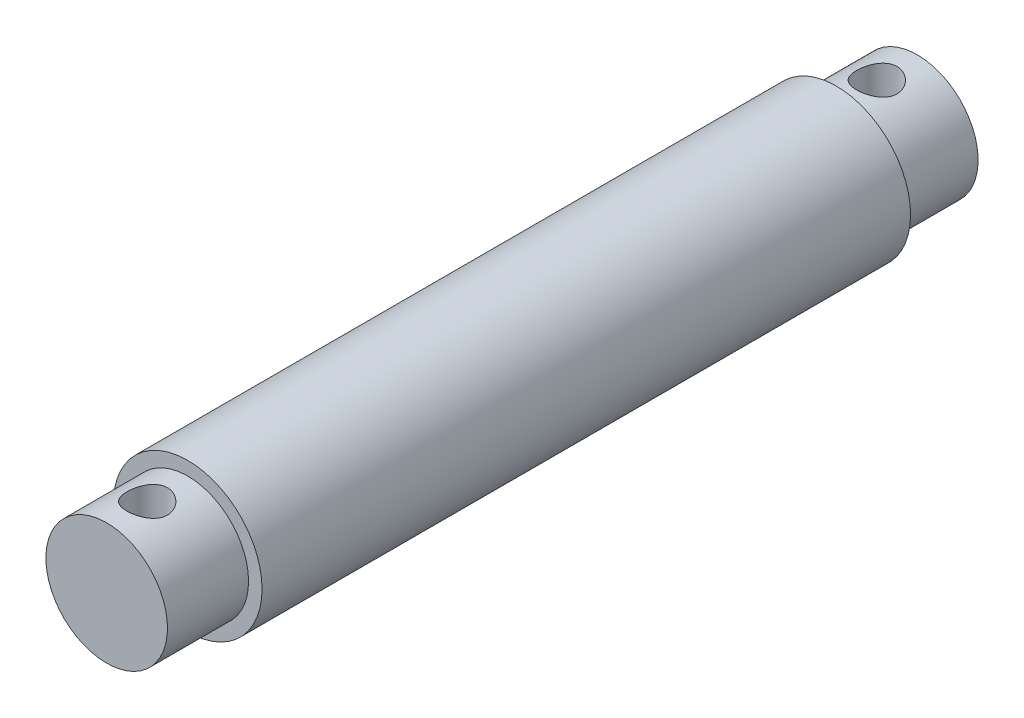
ISO-10303-21;
HEADER;
FILE_DESCRIPTION(('STEP AP214'),'2;1');
FILE_NAME('part.step','',(''),(''),'','','');
FILE_SCHEMA(('AUTOMOTIVE_DESIGN { 1 0 10303 214 1 1 1 1 }'));
ENDSEC;
DATA;
#1=APPLICATION_CONTEXT('core data for automotive mechanical design processes');
#2=APPLICATION_PROTOCOL_DEFINITION('international standard','automotive_design',2000,#1);
#3=PRODUCT_CONTEXT('',#1,'mechanical');
#4=PRODUCT('Part','Part','',(#3));
#5=PRODUCT_RELATED_PRODUCT_CATEGORY('part','',(#4));
#6=PRODUCT_DEFINITION_FORMATION('','',#4);
#7=PRODUCT_DEFINITION_CONTEXT('part definition',#1,'design');
#8=PRODUCT_DEFINITION('design','',#6,#7);
#9=PRODUCT_DEFINITION_SHAPE('','',#8);
#10=(LENGTH_UNIT() NAMED_UNIT(*) SI_UNIT(.MILLI.,.METRE.));
#11=(NAMED_UNIT(*) PLANE_ANGLE_UNIT() SI_UNIT($,.RADIAN.));
#12=(NAMED_UNIT(*) SI_UNIT($,.STERADIAN.) SOLID_ANGLE_UNIT());
#13=UNCERTAINTY_MEASURE_WITH_UNIT(LENGTH_MEASURE(1.E-05),#10,'distance_accuracy_value','');
#14=(GEOMETRIC_REPRESENTATION_CONTEXT(3) GLOBAL_UNCERTAINTY_ASSIGNED_CONTEXT((#13)) GLOBAL_UNIT_ASSIGNED_CONTEXT((#10,
#11,#12)) REPRESENTATION_CONTEXT('',''));
#15=CARTESIAN_POINT('',(0.,0.,0.));
#16=DIRECTION('',(0.,0.,1.));
#17=DIRECTION('',(1.,0.,0.));
#18=AXIS2_PLACEMENT_3D('',#15,#16,#17);
#19=CARTESIAN_POINT('',(0.,0.,48.));
#20=DIRECTION('',(0.,0.,-1.));
#21=DIRECTION('',(-1.,0.,0.));
#22=AXIS2_PLACEMENT_3D('',#19,#20,#21);
#23=CYLINDRICAL_SURFACE('',#22,5.5);
#24=CARTESIAN_POINT('',(0.,0.,48.));
#25=DIRECTION('',(0.,0.,1.));
#26=DIRECTION('',(1.,0.,0.));
#27=AXIS2_PLACEMENT_3D('',#24,#25,#26);
#28=CIRCLE('',#27,5.5);
#29=CARTESIAN_POINT('',(5.5,0.,48.));
#30=VERTEX_POINT('',#29);
#31=EDGE_CURVE('E62',#30,#30,#28,.T.);
#32=ORIENTED_EDGE('',*,*,#31,.F.);
#33=EDGE_LOOP('',(#32));
#34=FACE_BOUND('',#33,.T.);
#35=CARTESIAN_POINT('',(0.,0.,0.));
#36=DIRECTION('',(0.,0.,1.));
#37=DIRECTION('',(1.,0.,0.));
#38=AXIS2_PLACEMENT_3D('',#35,#36,#37);
#39=CIRCLE('',#38,5.5);
#40=CARTESIAN_POINT('',(5.5,0.,0.));
#41=VERTEX_POINT('',#40);
#42=EDGE_CURVE('E70',#41,#41,#39,.T.);
#43=ORIENTED_EDGE('',*,*,#42,.T.);
#44=EDGE_LOOP('',(#43));
#45=FACE_BOUND('',#44,.T.);
#46=ADVANCED_FACE('F43',(#34,#45),#23,.T.);
#47=CARTESIAN_POINT('',(0.,0.,48.));
#48=DIRECTION('',(0.,0.,1.));
#49=DIRECTION('',(1.,0.,0.));
#50=AXIS2_PLACEMENT_3D('',#47,#48,#49);
#51=PLANE('',#50);
#52=CARTESIAN_POINT('',(0.,0.,48.));
#53=DIRECTION('',(0.,0.,1.));
#54=DIRECTION('',(1.,0.,0.));
#55=AXIS2_PLACEMENT_3D('',#52,#53,#54);
#56=CIRCLE('',#55,4.5);
#57=CARTESIAN_POINT('',(4.5,0.,48.));
#58=VERTEX_POINT('',#57);
#59=EDGE_CURVE('E56',#58,#58,#56,.T.);
#60=ORIENTED_EDGE('',*,*,#59,.F.);
#61=EDGE_LOOP('',(#60));
#62=FACE_BOUND('',#61,.T.);
#63=ORIENTED_EDGE('',*,*,#31,.T.);
#64=EDGE_LOOP('',(#63));
#65=FACE_BOUND('',#64,.T.);
#66=ADVANCED_FACE('F119',(#62,#65),#51,.T.);
#67=CARTESIAN_POINT('',(0.,0.,0.));
#68=DIRECTION('',(0.,0.,1.));
#69=DIRECTION('',(1.,0.,0.));
#70=AXIS2_PLACEMENT_3D('',#67,#68,#69);
#71=PLANE('',#70);
#72=CARTESIAN_POINT('',(0.,0.,0.));
#73=DIRECTION('',(0.,0.,-1.));
#74=DIRECTION('',(-1.,0.,0.));
#75=AXIS2_PLACEMENT_3D('',#72,#73,#74);
#76=CIRCLE('',#75,4.5);
#77=CARTESIAN_POINT('',(-4.5,0.,0.));
#78=VERTEX_POINT('',#77);
#79=EDGE_CURVE('E10',#78,#78,#76,.T.);
#80=ORIENTED_EDGE('',*,*,#79,.F.);
#81=EDGE_LOOP('',(#80));
#82=FACE_BOUND('',#81,.T.);
#83=ORIENTED_EDGE('',*,*,#42,.F.);
#84=EDGE_LOOP('',(#83));
#85=FACE_BOUND('',#84,.T.);
#86=ADVANCED_FACE('F117',(#82,#85),#71,.F.);
#87=CARTESIAN_POINT('',(0.,0.,54.));
#88=DIRECTION('',(0.,0.,-1.));
#89=DIRECTION('',(-1.,0.,0.));
#90=AXIS2_PLACEMENT_3D('',#87,#88,#89);
#91=CYLINDRICAL_SURFACE('',#90,4.5);
#92=CARTESIAN_POINT('',(0.,-4.5,52.5));
#93=CARTESIAN_POINT('',(0.081845044330085,-4.50000022951416,52.5000003805975));
#94=CARTESIAN_POINT('',(0.163687791807825,-4.49774654261317,52.4932796008092));
#95=CARTESIAN_POINT('',(0.324962641309459,-4.48897815304921,52.4666563367742));
#96=CARTESIAN_POINT('',(0.404394492178227,-4.48246300803229,52.4467524840766));
#97=CARTESIAN_POINT('',(0.558499184252666,-4.46587961859664,52.3945211349239));
#98=CARTESIAN_POINT('',(0.633179738829053,-4.4558173159628,52.3622144063111));
#99=CARTESIAN_POINT('',(0.776062405207989,-4.43316668576013,52.2861882407425));
#100=CARTESIAN_POINT('',(0.844263235438061,-4.42057786001667,52.2424665524961));
#101=CARTESIAN_POINT('',(0.974612512533401,-4.39371141664507,52.1432612927119));
#102=CARTESIAN_POINT('',(1.03650555044747,-4.37939334695677,52.0874531486093));
#103=CARTESIAN_POINT('',(1.15024903905313,-4.35090472174682,51.9663492679402));
#104=CARTESIAN_POINT('',(1.20209727823419,-4.33673419935824,51.9010514476072));
#105=CARTESIAN_POINT('',(1.29573741334179,-4.30969998715911,51.7605223272053));
#106=CARTESIAN_POINT('',(1.33719728733155,-4.29688558913532,51.6850593904018));
#107=CARTESIAN_POINT('',(1.40672831081658,-4.27462958127902,51.5277358583122));
#108=CARTESIAN_POINT('',(1.43480354608015,-4.26518694241118,51.4458772242559));
#109=CARTESIAN_POINT('',(1.47581019226375,-4.25116954904066,51.2809901677549));
#110=CARTESIAN_POINT('',(1.48922017240765,-4.24644143654417,51.1980941872664));
#111=CARTESIAN_POINT('',(1.50201168500172,-4.24193484944261,51.0311043687662));
#112=CARTESIAN_POINT('',(1.50139755240708,-4.24215484534095,50.9470109089362));
#113=CARTESIAN_POINT('',(1.48652985555513,-4.2473852251227,50.784095054334));
#114=CARTESIAN_POINT('',(1.47290086975049,-4.25217623801299,50.7052073956215));
#115=CARTESIAN_POINT('',(1.43340924427412,-4.26564986586826,50.5509098705897));
#116=CARTESIAN_POINT('',(1.4075451398878,-4.27433294676161,50.4755004218474));
#117=CARTESIAN_POINT('',(1.34390858709031,-4.29476866696873,50.3288808756128));
#118=CARTESIAN_POINT('',(1.30595107306089,-4.30656848689676,50.2577579617957));
#119=CARTESIAN_POINT('',(1.21933365945471,-4.3318883786359,50.1226936375804));
#120=CARTESIAN_POINT('',(1.17067066854601,-4.34540894685695,50.0587543095999));
#121=CARTESIAN_POINT('',(1.06102399902336,-4.37350993751611,49.9363626027588));
#122=CARTESIAN_POINT('',(0.999529725114467,-4.38810884032264,49.8783709582364));
#123=CARTESIAN_POINT('',(0.867509354955095,-4.41610407580555,49.7734031000049));
#124=CARTESIAN_POINT('',(0.796982393491219,-4.42950029307101,49.7264279427532));
#125=CARTESIAN_POINT('',(0.6479214195694,-4.4537566190669,49.6444555496474));
#126=CARTESIAN_POINT('',(0.569314914624506,-4.46459025012059,49.6095817629889));
#127=CARTESIAN_POINT('',(0.406903625046763,-4.48230850716652,49.5536952390664));
#128=CARTESIAN_POINT('',(0.323100657232431,-4.48919450482319,49.5326776868648));
#129=CARTESIAN_POINT('',(0.156575744293956,-4.49801440607161,49.5059165009665));
#130=CARTESIAN_POINT('',(0.0739643997972691,-4.50015002750592,49.4995502862409));
#131=CARTESIAN_POINT('',(-0.0911626049403566,-4.49983354042241,49.5004990103977));
#132=CARTESIAN_POINT('',(-0.173678278979476,-4.49738220629043,49.5078116399698));
#133=CARTESIAN_POINT('',(-0.333779799456384,-4.48830037075656,49.5354178616039));
#134=CARTESIAN_POINT('',(-0.411439210252265,-4.48179298066788,49.5553293090742));
#135=CARTESIAN_POINT('',(-0.562283937869361,-4.46537770245105,49.6070901667001));
#136=CARTESIAN_POINT('',(-0.63546868276291,-4.45546938070013,49.6389410992017));
#137=CARTESIAN_POINT('',(-0.777432444589911,-4.43293396930935,49.7146056477612));
#138=CARTESIAN_POINT('',(-0.846044938825721,-4.42024222133679,49.7587118899248));
#139=CARTESIAN_POINT('',(-0.97509724520338,-4.39357880874394,49.8572912250202));
#140=CARTESIAN_POINT('',(-1.03553455169337,-4.37960675390741,49.9117674840476));
#141=CARTESIAN_POINT('',(-1.14937876170945,-4.35115271970667,50.0324681265099));
#142=CARTESIAN_POINT('',(-1.20234145386866,-4.33667641631142,50.0991138403903));
#143=CARTESIAN_POINT('',(-1.29638628348536,-4.30949959942063,50.2406573517163));
#144=CARTESIAN_POINT('',(-1.33746832189652,-4.29679910073003,50.3155552179511));
#145=CARTESIAN_POINT('',(-1.40639539562454,-4.27473587687075,50.4715095229348));
#146=CARTESIAN_POINT('',(-1.43426719824753,-4.26536641189468,50.5525531187531));
#147=CARTESIAN_POINT('',(-1.47584200013903,-4.25116248459674,50.7185679750662));
#148=CARTESIAN_POINT('',(-1.48955138243091,-4.24632597935459,50.8035374481065));
#149=CARTESIAN_POINT('',(-1.50191442371601,-4.24196788311266,50.9702956440614));
#150=CARTESIAN_POINT('',(-1.5013053859626,-4.24218600386123,51.0520235104302));
#151=CARTESIAN_POINT('',(-1.48686344017304,-4.24726904735801,51.2141476123831));
#152=CARTESIAN_POINT('',(-1.47303131918788,-4.25213369354042,51.2945439269326));
#153=CARTESIAN_POINT('',(-1.43305771969402,-4.26576786457337,51.4502034945037));
#154=CARTESIAN_POINT('',(-1.40715501902327,-4.27446147033716,51.5255352375067));
#155=CARTESIAN_POINT('',(-1.34396904863962,-4.29474598227703,51.6708411104074));
#156=CARTESIAN_POINT('',(-1.30668325283071,-4.30633753145089,51.740814046782));
#157=CARTESIAN_POINT('',(-1.21989103887515,-4.33174243839069,51.8767255048844));
#158=CARTESIAN_POINT('',(-1.16992236414688,-4.34563067463205,51.9423547528476));
#159=CARTESIAN_POINT('',(-1.05996432470348,-4.37375034424879,52.0645347200763));
#160=CARTESIAN_POINT('',(-0.999972126677225,-4.38798187368558,52.1210828635321));
#161=CARTESIAN_POINT('',(-0.868862335381033,-4.41585045788316,52.2257166184338));
#162=CARTESIAN_POINT('',(-0.797402270249594,-4.42944272701885,52.2733865216265));
#163=CARTESIAN_POINT('',(-0.647036036109938,-4.45388986758918,52.355985643276));
#164=CARTESIAN_POINT('',(-0.568131777198522,-4.46474543861895,52.3909181188831));
#165=CARTESIAN_POINT('',(-0.408740470801463,-4.48208272602813,52.445582448733));
#166=CARTESIAN_POINT('',(-0.328481636514612,-4.48873818633784,52.4659236993951));
#167=CARTESIAN_POINT('',(-0.16548062401537,-4.49769610596333,52.4931304210157));
#168=CARTESIAN_POINT('',(-0.0827391383531194,-4.49999976797857,52.4999996152448));
#169=CARTESIAN_POINT('',(0.,-4.5,52.5));
#170=B_SPLINE_CURVE_WITH_KNOTS('',3,(#92,#93,#94,#95,#96,#97,#98,#99,#100,#101,#102,#103,#104,
#105,#106,#107,#108,#109,#110,#111,#112,#113,#114,#115,#116,#117,#118,#119,#120,#121,#122,#123,
#124,#125,#126,#127,#128,#129,#130,#131,#132,#133,#134,#135,#136,#137,#138,#139,#140,#141,#142,
#143,#144,#145,#146,#147,#148,#149,#150,#151,#152,#153,#154,#155,#156,#157,#158,#159,#160,#161,
#162,#163,#164,#165,#166,#167,#168,#169),.UNSPECIFIED.,.T.,.F.,(4,2,2,2,2,2,2,2,2,2,2,2,2,2,2,2,
2,2,2,2,2,2,2,2,2,2,2,2,2,2,2,2,2,2,2,2,2,2,4),(0.,0.245230659039017,0.490486777901282,
0.735334009305415,0.980229566698654,1.23277026424134,1.48536649931296,1.74522577235206,
2.0050056703925,2.2560288861276,2.50697450981229,2.74645239826921,2.98595896283224,
3.22932256732697,3.47275653837311,3.72889958717051,3.98506718949928,4.24377608475536,
4.50239503315813,4.74980374762755,4.99717069746265,5.23737236967321,5.47760467926156,
5.72415599765606,5.97078271232837,6.22861534321128,6.48645012352495,6.74376020740157,
7.00095427058761,7.24493499096388,7.48890119027063,7.72823380620626,7.96761957263966,
8.21745100037707,8.46735316685669,8.72699491252651,8.98657021728685,9.23454837560721,
9.4824579905721),.UNSPECIFIED.);
#171=CARTESIAN_POINT('',(0.,-4.5,52.5));
#172=VERTEX_POINT('',#171);
#173=EDGE_CURVE('E46',#172,#172,#170,.T.);
#174=ORIENTED_EDGE('',*,*,#173,.T.);
#175=EDGE_LOOP('',(#174));
#176=FACE_BOUND('',#175,.T.);
#177=CARTESIAN_POINT('',(0.,4.5,52.5));
#178=CARTESIAN_POINT('',(-0.081845044330085,4.50000022951416,52.5000003805975));
#179=CARTESIAN_POINT('',(-0.163687791807825,4.49774654261317,52.4932796008092));
#180=CARTESIAN_POINT('',(-0.324962641309459,4.48897815304921,52.4666563367742));
#181=CARTESIAN_POINT('',(-0.404394492178227,4.48246300803229,52.4467524840766));
#182=CARTESIAN_POINT('',(-0.558499184252666,4.46587961859664,52.3945211349239));
#183=CARTESIAN_POINT('',(-0.633179738829053,4.4558173159628,52.3622144063111));
#184=CARTESIAN_POINT('',(-0.776062405207989,4.43316668576013,52.2861882407425));
#185=CARTESIAN_POINT('',(-0.844263235438061,4.42057786001667,52.2424665524961));
#186=CARTESIAN_POINT('',(-0.974612512533401,4.39371141664507,52.1432612927119));
#187=CARTESIAN_POINT('',(-1.03650555044747,4.37939334695677,52.0874531486093));
#188=CARTESIAN_POINT('',(-1.15024903905313,4.35090472174682,51.9663492679402));
#189=CARTESIAN_POINT('',(-1.20209727823419,4.33673419935824,51.9010514476072));
#190=CARTESIAN_POINT('',(-1.29573741334179,4.30969998715911,51.7605223272053));
#191=CARTESIAN_POINT('',(-1.33719728733155,4.29688558913532,51.6850593904018));
#192=CARTESIAN_POINT('',(-1.40672831081658,4.27462958127902,51.5277358583122));
#193=CARTESIAN_POINT('',(-1.43480354608015,4.26518694241118,51.4458772242559));
#194=CARTESIAN_POINT('',(-1.47581019226375,4.25116954904066,51.2809901677549));
#195=CARTESIAN_POINT('',(-1.48922017240765,4.24644143654417,51.1980941872664));
#196=CARTESIAN_POINT('',(-1.50201168500172,4.24193484944261,51.0311043687662));
#197=CARTESIAN_POINT('',(-1.50139755240708,4.24215484534095,50.9470109089362));
#198=CARTESIAN_POINT('',(-1.48652985555513,4.2473852251227,50.784095054334));
#199=CARTESIAN_POINT('',(-1.47290086975049,4.25217623801299,50.7052073956215));
#200=CARTESIAN_POINT('',(-1.43340924427412,4.26564986586826,50.5509098705897));
#201=CARTESIAN_POINT('',(-1.4075451398878,4.27433294676161,50.4755004218474));
#202=CARTESIAN_POINT('',(-1.34390858709031,4.29476866696873,50.3288808756128));
#203=CARTESIAN_POINT('',(-1.30595107306089,4.30656848689676,50.2577579617957));
#204=CARTESIAN_POINT('',(-1.21933365945471,4.3318883786359,50.1226936375804));
#205=CARTESIAN_POINT('',(-1.17067066854601,4.34540894685695,50.0587543095999));
#206=CARTESIAN_POINT('',(-1.06102399902336,4.37350993751611,49.9363626027588));
#207=CARTESIAN_POINT('',(-0.999529725114467,4.38810884032264,49.8783709582364));
#208=CARTESIAN_POINT('',(-0.867509354955095,4.41610407580555,49.7734031000049));
#209=CARTESIAN_POINT('',(-0.796982393491219,4.42950029307101,49.7264279427532));
#210=CARTESIAN_POINT('',(-0.6479214195694,4.4537566190669,49.6444555496474));
#211=CARTESIAN_POINT('',(-0.569314914624506,4.46459025012059,49.6095817629889));
#212=CARTESIAN_POINT('',(-0.406903625046763,4.48230850716652,49.5536952390664));
#213=CARTESIAN_POINT('',(-0.323100657232431,4.48919450482319,49.5326776868648));
#214=CARTESIAN_POINT('',(-0.156575744293956,4.49801440607161,49.5059165009665));
#215=CARTESIAN_POINT('',(-0.0739643997972691,4.50015002750592,49.4995502862409));
#216=CARTESIAN_POINT('',(0.0911626049403566,4.49983354042241,49.5004990103977));
#217=CARTESIAN_POINT('',(0.173678278979476,4.49738220629043,49.5078116399698));
#218=CARTESIAN_POINT('',(0.333779799456384,4.48830037075656,49.5354178616039));
#219=CARTESIAN_POINT('',(0.411439210252265,4.48179298066788,49.5553293090742));
#220=CARTESIAN_POINT('',(0.562283937869361,4.46537770245105,49.6070901667001));
#221=CARTESIAN_POINT('',(0.63546868276291,4.45546938070013,49.6389410992017));
#222=CARTESIAN_POINT('',(0.777432444589911,4.43293396930935,49.7146056477612));
#223=CARTESIAN_POINT('',(0.846044938825721,4.42024222133679,49.7587118899248));
#224=CARTESIAN_POINT('',(0.97509724520338,4.39357880874394,49.8572912250202));
#225=CARTESIAN_POINT('',(1.03553455169337,4.37960675390741,49.9117674840476));
#226=CARTESIAN_POINT('',(1.14937876170945,4.35115271970667,50.0324681265099));
#227=CARTESIAN_POINT('',(1.20234145386866,4.33667641631142,50.0991138403903));
#228=CARTESIAN_POINT('',(1.29638628348536,4.30949959942063,50.2406573517163));
#229=CARTESIAN_POINT('',(1.33746832189652,4.29679910073003,50.3155552179511));
#230=CARTESIAN_POINT('',(1.40639539562454,4.27473587687075,50.4715095229348));
#231=CARTESIAN_POINT('',(1.43426719824753,4.26536641189468,50.5525531187531));
#232=CARTESIAN_POINT('',(1.47584200013903,4.25116248459674,50.7185679750662));
#233=CARTESIAN_POINT('',(1.48955138243091,4.24632597935459,50.8035374481065));
#234=CARTESIAN_POINT('',(1.50191442371601,4.24196788311266,50.9702956440614));
#235=CARTESIAN_POINT('',(1.5013053859626,4.24218600386123,51.0520235104302));
#236=CARTESIAN_POINT('',(1.48686344017304,4.24726904735801,51.2141476123831));
#237=CARTESIAN_POINT('',(1.47303131918788,4.25213369354042,51.2945439269326));
#238=CARTESIAN_POINT('',(1.43305771969402,4.26576786457337,51.4502034945037));
#239=CARTESIAN_POINT('',(1.40715501902327,4.27446147033716,51.5255352375067));
#240=CARTESIAN_POINT('',(1.34396904863962,4.29474598227703,51.6708411104074));
#241=CARTESIAN_POINT('',(1.30668325283071,4.30633753145089,51.740814046782));
#242=CARTESIAN_POINT('',(1.21989103887515,4.33174243839069,51.8767255048844));
#243=CARTESIAN_POINT('',(1.16992236414688,4.34563067463205,51.9423547528476));
#244=CARTESIAN_POINT('',(1.05996432470348,4.37375034424879,52.0645347200763));
#245=CARTESIAN_POINT('',(0.999972126677225,4.38798187368558,52.1210828635321));
#246=CARTESIAN_POINT('',(0.868862335381033,4.41585045788316,52.2257166184338));
#247=CARTESIAN_POINT('',(0.797402270249594,4.42944272701885,52.2733865216265));
#248=CARTESIAN_POINT('',(0.647036036109938,4.45388986758918,52.355985643276));
#249=CARTESIAN_POINT('',(0.568131777198522,4.46474543861895,52.3909181188831));
#250=CARTESIAN_POINT('',(0.408740470801463,4.48208272602813,52.445582448733));
#251=CARTESIAN_POINT('',(0.328481636514612,4.48873818633784,52.4659236993951));
#252=CARTESIAN_POINT('',(0.16548062401537,4.49769610596333,52.4931304210157));
#253=CARTESIAN_POINT('',(0.0827391383531194,4.49999976797857,52.4999996152448));
#254=CARTESIAN_POINT('',(0.,4.5,52.5));
#255=B_SPLINE_CURVE_WITH_KNOTS('',3,(#177,#178,#179,#180,#181,#182,#183,#184,#185,#186,#187,
#188,#189,#190,#191,#192,#193,#194,#195,#196,#197,#198,#199,#200,#201,#202,#203,#204,#205,#206,
#207,#208,#209,#210,#211,#212,#213,#214,#215,#216,#217,#218,#219,#220,#221,#222,#223,#224,#225,
#226,#227,#228,#229,#230,#231,#232,#233,#234,#235,#236,#237,#238,#239,#240,#241,#242,#243,#244,
#245,#246,#247,#248,#249,#250,#251,#252,#253,#254),.UNSPECIFIED.,.T.,.F.,(4,2,2,2,2,2,2,2,2,2,2,
2,2,2,2,2,2,2,2,2,2,2,2,2,2,2,2,2,2,2,2,2,2,2,2,2,2,2,4),(0.,0.245230659039017,
0.490486777901282,0.735334009305415,0.980229566698654,1.23277026424134,1.48536649931296,
1.74522577235206,2.0050056703925,2.2560288861276,2.50697450981229,2.74645239826921,
2.98595896283224,3.22932256732697,3.47275653837311,3.72889958717051,3.98506718949928,
4.24377608475536,4.50239503315813,4.74980374762755,4.99717069746265,5.23737236967321,
5.47760467926156,5.72415599765606,5.97078271232837,6.22861534321128,6.48645012352495,
6.74376020740157,7.00095427058761,7.24493499096388,7.48890119027063,7.72823380620626,
7.96761957263966,8.21745100037707,8.46735316685669,8.72699491252651,8.98657021728685,
9.23454837560721,9.4824579905721),.UNSPECIFIED.);
#256=CARTESIAN_POINT('',(0.,4.5,52.5));
#257=VERTEX_POINT('',#256);
#258=EDGE_CURVE('E106',#257,#257,#255,.T.);
#259=ORIENTED_EDGE('',*,*,#258,.T.);
#260=EDGE_LOOP('',(#259));
#261=FACE_BOUND('',#260,.T.);
#262=CARTESIAN_POINT('',(0.,0.,54.));
#263=DIRECTION('',(0.,0.,1.));
#264=DIRECTION('',(1.,0.,0.));
#265=AXIS2_PLACEMENT_3D('',#262,#263,#264);
#266=CIRCLE('',#265,4.5);
#267=CARTESIAN_POINT('',(4.5,0.,54.));
#268=VERTEX_POINT('',#267);
#269=EDGE_CURVE('E67',#268,#268,#266,.T.);
#270=ORIENTED_EDGE('',*,*,#269,.F.);
#271=EDGE_LOOP('',(#270));
#272=FACE_BOUND('',#271,.T.);
#273=ORIENTED_EDGE('',*,*,#59,.T.);
#274=EDGE_LOOP('',(#273));
#275=FACE_BOUND('',#274,.T.);
#276=ADVANCED_FACE('F112',(#176,#261,#272,#275),#91,.T.);
#277=CARTESIAN_POINT('',(0.,0.,54.));
#278=DIRECTION('',(0.,0.,1.));
#279=DIRECTION('',(1.,0.,0.));
#280=AXIS2_PLACEMENT_3D('',#277,#278,#279);
#281=PLANE('',#280);
#282=ORIENTED_EDGE('',*,*,#269,.T.);
#283=EDGE_LOOP('',(#282));
#284=FACE_BOUND('',#283,.T.);
#285=ADVANCED_FACE('F116',(#284),#281,.T.);
#286=CARTESIAN_POINT('',(0.,0.,-6.));
#287=DIRECTION('',(0.,0.,1.));
#288=DIRECTION('',(1.,0.,0.));
#289=AXIS2_PLACEMENT_3D('',#286,#287,#288);
#290=CYLINDRICAL_SURFACE('',#289,4.5);
#291=CARTESIAN_POINT('',(0.,-4.5,-1.5));
#292=CARTESIAN_POINT('',(0.0818450443300848,-4.50000022951416,-1.49999961940254));
#293=CARTESIAN_POINT('',(0.163687791807825,-4.49774654261317,-1.50672039919083));
#294=CARTESIAN_POINT('',(0.324962641309458,-4.48897815304921,-1.53334366322583));
#295=CARTESIAN_POINT('',(0.404394492178227,-4.48246300803229,-1.55324751592338));
#296=CARTESIAN_POINT('',(0.558499184252664,-4.46587961859664,-1.60547886507607));
#297=CARTESIAN_POINT('',(0.633179738829051,-4.4558173159628,-1.63778559368891));
#298=CARTESIAN_POINT('',(0.776062405207987,-4.43316668576013,-1.71381175925752));
#299=CARTESIAN_POINT('',(0.844263235438059,-4.42057786001667,-1.7575334475039));
#300=CARTESIAN_POINT('',(0.9746125125334,-4.39371141664507,-1.85673870728813));
#301=CARTESIAN_POINT('',(1.03650555044746,-4.37939334695677,-1.91254685139074));
#302=CARTESIAN_POINT('',(1.15024903905313,-4.35090472174682,-2.03365073205985));
#303=CARTESIAN_POINT('',(1.20209727823419,-4.33673419935824,-2.09894855239277));
#304=CARTESIAN_POINT('',(1.29573741334179,-4.30969998715911,-2.23947767279469));
#305=CARTESIAN_POINT('',(1.33719728733155,-4.29688558913532,-2.31494060959818));
#306=CARTESIAN_POINT('',(1.40672831081658,-4.27462958127902,-2.47226414168782));
#307=CARTESIAN_POINT('',(1.43480354608015,-4.26518694241118,-2.55412277574412));
#308=CARTESIAN_POINT('',(1.47581019226374,-4.25116954904066,-2.71900983224507));
#309=CARTESIAN_POINT('',(1.48922017240765,-4.24644143654417,-2.8019058127336));
#310=CARTESIAN_POINT('',(1.50201168500172,-4.24193484944261,-2.96889563123382));
#311=CARTESIAN_POINT('',(1.50139755240708,-4.24215484534095,-3.05298909106379));
#312=CARTESIAN_POINT('',(1.48652985555513,-4.2473852251227,-3.21590494566603));
#313=CARTESIAN_POINT('',(1.47290086975049,-4.25217623801299,-3.29479260437853));
#314=CARTESIAN_POINT('',(1.43340924427413,-4.26564986586826,-3.44909012941025));
#315=CARTESIAN_POINT('',(1.40754513988781,-4.27433294676161,-3.5244995781526));
#316=CARTESIAN_POINT('',(1.34390858709032,-4.29476866696873,-3.67111912438722));
#317=CARTESIAN_POINT('',(1.30595107306089,-4.30656848689676,-3.74224203820429));
#318=CARTESIAN_POINT('',(1.21933365945471,-4.3318883786359,-3.87730636241959));
#319=CARTESIAN_POINT('',(1.17067066854601,-4.34540894685695,-3.94124569040007));
#320=CARTESIAN_POINT('',(1.06102399902336,-4.37350993751611,-4.06363739724116));
#321=CARTESIAN_POINT('',(0.999529725114467,-4.38810884032264,-4.1216290417636));
#322=CARTESIAN_POINT('',(0.867509354955096,-4.41610407580555,-4.2265968999951));
#323=CARTESIAN_POINT('',(0.796982393491222,-4.42950029307101,-4.27357205724674));
#324=CARTESIAN_POINT('',(0.647921419569402,-4.4537566190669,-4.3555444503526));
#325=CARTESIAN_POINT('',(0.569314914624505,-4.46459025012059,-4.3904182370111));
#326=CARTESIAN_POINT('',(0.406903625046761,-4.48230850716652,-4.44630476093357));
#327=CARTESIAN_POINT('',(0.323100657232431,-4.48919450482319,-4.46732231313516));
#328=CARTESIAN_POINT('',(0.156575744293956,-4.49801440607161,-4.49408349903354));
#329=CARTESIAN_POINT('',(0.0739643997972698,-4.50015002750592,-4.50044971375913));
#330=CARTESIAN_POINT('',(-0.0911626049403558,-4.49983354042241,-4.4995009896023));
#331=CARTESIAN_POINT('',(-0.173678278979476,-4.49738220629043,-4.49218836003019));
#332=CARTESIAN_POINT('',(-0.333779799456383,-4.48830037075656,-4.46458213839606));
#333=CARTESIAN_POINT('',(-0.411439210252265,-4.48179298066788,-4.44467069092576));
#334=CARTESIAN_POINT('',(-0.56228393786936,-4.46537770245105,-4.39290983329991));
#335=CARTESIAN_POINT('',(-0.63546868276291,-4.45546938070013,-4.36105890079832));
#336=CARTESIAN_POINT('',(-0.77743244458991,-4.43293396930935,-4.28539435223882));
#337=CARTESIAN_POINT('',(-0.846044938825721,-4.42024222133679,-4.24128811007524));
#338=CARTESIAN_POINT('',(-0.97509724520338,-4.39357880874394,-4.14270877497977));
#339=CARTESIAN_POINT('',(-1.03553455169337,-4.37960675390741,-4.08823251595235));
#340=CARTESIAN_POINT('',(-1.14937876170945,-4.35115271970667,-3.96753187349012));
#341=CARTESIAN_POINT('',(-1.20234145386866,-4.33667641631142,-3.90088615960971));
#342=CARTESIAN_POINT('',(-1.29638628348536,-4.30949959942063,-3.75934264828367));
#343=CARTESIAN_POINT('',(-1.33746832189652,-4.29679910073003,-3.68444478204889));
#344=CARTESIAN_POINT('',(-1.40639539562454,-4.27473587687075,-3.52849047706516));
#345=CARTESIAN_POINT('',(-1.43426719824753,-4.26536641189468,-3.44744688124685));
#346=CARTESIAN_POINT('',(-1.47584200013903,-4.25116248459674,-3.2814320249338));
#347=CARTESIAN_POINT('',(-1.48955138243091,-4.24632597935459,-3.19646255189348));
#348=CARTESIAN_POINT('',(-1.50191442371601,-4.24196788311266,-3.02970435593862));
#349=CARTESIAN_POINT('',(-1.5013053859626,-4.24218600386123,-2.94797648956976));
#350=CARTESIAN_POINT('',(-1.48686344017304,-4.24726904735801,-2.78585238761691));
#351=CARTESIAN_POINT('',(-1.47303131918788,-4.25213369354042,-2.70545607306737));
#352=CARTESIAN_POINT('',(-1.43305771969402,-4.26576786457337,-2.54979650549629));
#353=CARTESIAN_POINT('',(-1.40715501902327,-4.27446147033716,-2.47446476249325));
#354=CARTESIAN_POINT('',(-1.34396904863962,-4.29474598227703,-2.3291588895926));
#355=CARTESIAN_POINT('',(-1.30668325283071,-4.3063375314509,-2.25918595321799));
#356=CARTESIAN_POINT('',(-1.21989103887514,-4.33174243839069,-2.12327449511563));
#357=CARTESIAN_POINT('',(-1.16992236414687,-4.34563067463206,-2.05764524715242));
#358=CARTESIAN_POINT('',(-1.05996432470347,-4.37375034424879,-1.9354652799237));
#359=CARTESIAN_POINT('',(-0.999972126677222,-4.38798187368559,-1.87891713646789));
#360=CARTESIAN_POINT('',(-0.868862335381032,-4.41585045788316,-1.77428338156623));
#361=CARTESIAN_POINT('',(-0.797402270249593,-4.42944272701885,-1.7266134783735));
#362=CARTESIAN_POINT('',(-0.647036036109937,-4.45388986758918,-1.64401435672403));
#363=CARTESIAN_POINT('',(-0.568131777198522,-4.46474543861895,-1.60908188111694));
#364=CARTESIAN_POINT('',(-0.408740470801464,-4.48208272602813,-1.55441755126699));
#365=CARTESIAN_POINT('',(-0.328481636514613,-4.48873818633784,-1.53407630060494));
#366=CARTESIAN_POINT('',(-0.165480624015371,-4.49769610596333,-1.50686957898431));
#367=CARTESIAN_POINT('',(-0.0827391383531198,-4.49999976797857,-1.50000038475519));
#368=CARTESIAN_POINT('',(0.,-4.5,-1.5));
#369=B_SPLINE_CURVE_WITH_KNOTS('',3,(#291,#292,#293,#294,#295,#296,#297,#298,#299,#300,#301,
#302,#303,#304,#305,#306,#307,#308,#309,#310,#311,#312,#313,#314,#315,#316,#317,#318,#319,#320,
#321,#322,#323,#324,#325,#326,#327,#328,#329,#330,#331,#332,#333,#334,#335,#336,#337,#338,#339,
#340,#341,#342,#343,#344,#345,#346,#347,#348,#349,#350,#351,#352,#353,#354,#355,#356,#357,#358,
#359,#360,#361,#362,#363,#364,#365,#366,#367,#368),.UNSPECIFIED.,.T.,.F.,(4,2,2,2,2,2,2,2,2,2,2,
2,2,2,2,2,2,2,2,2,2,2,2,2,2,2,2,2,2,2,2,2,2,2,2,2,2,2,4),(0.,0.245230659039016,
0.490486777901281,0.735334009305411,0.98022956669865,1.23277026424134,1.48536649931295,
1.74522577235206,2.0050056703925,2.2560288861276,2.50697450981228,2.7464523982692,
2.98595896283223,3.22932256732696,3.47275653837311,3.7288995871705,3.98506718949927,
4.24377608475536,4.50239503315812,4.74980374762754,4.99717069746265,5.2373723696732,
5.47760467926156,5.72415599765605,5.97078271232837,6.22861534321128,6.48645012352495,
6.74376020740156,7.0009542705876,7.24493499096388,7.48890119027063,7.72823380620626,
7.96761957263967,8.21745100037707,8.46735316685668,8.72699491252651,8.98657021728685,
9.23454837560721,9.4824579905721),.UNSPECIFIED.);
#370=CARTESIAN_POINT('',(0.,-4.5,-1.5));
#371=VERTEX_POINT('',#370);
#372=EDGE_CURVE('E87',#371,#371,#369,.T.);
#373=ORIENTED_EDGE('',*,*,#372,.T.);
#374=EDGE_LOOP('',(#373));
#375=FACE_BOUND('',#374,.T.);
#376=CARTESIAN_POINT('',(0.,4.5,-1.5));
#377=CARTESIAN_POINT('',(-0.0818450443300848,4.50000022951416,-1.49999961940254));
#378=CARTESIAN_POINT('',(-0.163687791807825,4.49774654261317,-1.50672039919083));
#379=CARTESIAN_POINT('',(-0.324962641309458,4.48897815304921,-1.53334366322583));
#380=CARTESIAN_POINT('',(-0.404394492178227,4.48246300803229,-1.55324751592338));
#381=CARTESIAN_POINT('',(-0.558499184252664,4.46587961859664,-1.60547886507607));
#382=CARTESIAN_POINT('',(-0.633179738829051,4.4558173159628,-1.63778559368891));
#383=CARTESIAN_POINT('',(-0.776062405207987,4.43316668576013,-1.71381175925752));
#384=CARTESIAN_POINT('',(-0.844263235438059,4.42057786001667,-1.7575334475039));
#385=CARTESIAN_POINT('',(-0.9746125125334,4.39371141664507,-1.85673870728813));
#386=CARTESIAN_POINT('',(-1.03650555044746,4.37939334695677,-1.91254685139074));
#387=CARTESIAN_POINT('',(-1.15024903905313,4.35090472174682,-2.03365073205985));
#388=CARTESIAN_POINT('',(-1.20209727823419,4.33673419935824,-2.09894855239277));
#389=CARTESIAN_POINT('',(-1.29573741334179,4.30969998715911,-2.23947767279469));
#390=CARTESIAN_POINT('',(-1.33719728733155,4.29688558913532,-2.31494060959818));
#391=CARTESIAN_POINT('',(-1.40672831081658,4.27462958127902,-2.47226414168782));
#392=CARTESIAN_POINT('',(-1.43480354608015,4.26518694241118,-2.55412277574412));
#393=CARTESIAN_POINT('',(-1.47581019226374,4.25116954904066,-2.71900983224507));
#394=CARTESIAN_POINT('',(-1.48922017240765,4.24644143654417,-2.8019058127336));
#395=CARTESIAN_POINT('',(-1.50201168500172,4.24193484944261,-2.96889563123382));
#396=CARTESIAN_POINT('',(-1.50139755240708,4.24215484534095,-3.05298909106379));
#397=CARTESIAN_POINT('',(-1.48652985555513,4.2473852251227,-3.21590494566603));
#398=CARTESIAN_POINT('',(-1.47290086975049,4.25217623801299,-3.29479260437853));
#399=CARTESIAN_POINT('',(-1.43340924427413,4.26564986586826,-3.44909012941025));
#400=CARTESIAN_POINT('',(-1.40754513988781,4.27433294676161,-3.5244995781526));
#401=CARTESIAN_POINT('',(-1.34390858709032,4.29476866696873,-3.67111912438722));
#402=CARTESIAN_POINT('',(-1.30595107306089,4.30656848689676,-3.74224203820429));
#403=CARTESIAN_POINT('',(-1.21933365945471,4.3318883786359,-3.87730636241959));
#404=CARTESIAN_POINT('',(-1.17067066854601,4.34540894685695,-3.94124569040007));
#405=CARTESIAN_POINT('',(-1.06102399902336,4.37350993751611,-4.06363739724116));
#406=CARTESIAN_POINT('',(-0.999529725114467,4.38810884032264,-4.1216290417636));
#407=CARTESIAN_POINT('',(-0.867509354955096,4.41610407580555,-4.2265968999951));
#408=CARTESIAN_POINT('',(-0.796982393491222,4.42950029307101,-4.27357205724674));
#409=CARTESIAN_POINT('',(-0.647921419569402,4.4537566190669,-4.3555444503526));
#410=CARTESIAN_POINT('',(-0.569314914624505,4.46459025012059,-4.3904182370111));
#411=CARTESIAN_POINT('',(-0.406903625046761,4.48230850716652,-4.44630476093357));
#412=CARTESIAN_POINT('',(-0.323100657232431,4.48919450482319,-4.46732231313516));
#413=CARTESIAN_POINT('',(-0.156575744293956,4.49801440607161,-4.49408349903354));
#414=CARTESIAN_POINT('',(-0.0739643997972698,4.50015002750592,-4.50044971375913));
#415=CARTESIAN_POINT('',(0.0911626049403558,4.49983354042241,-4.4995009896023));
#416=CARTESIAN_POINT('',(0.173678278979476,4.49738220629043,-4.49218836003019));
#417=CARTESIAN_POINT('',(0.333779799456383,4.48830037075656,-4.46458213839606));
#418=CARTESIAN_POINT('',(0.411439210252265,4.48179298066788,-4.44467069092576));
#419=CARTESIAN_POINT('',(0.56228393786936,4.46537770245105,-4.39290983329991));
#420=CARTESIAN_POINT('',(0.63546868276291,4.45546938070013,-4.36105890079832));
#421=CARTESIAN_POINT('',(0.77743244458991,4.43293396930935,-4.28539435223882));
#422=CARTESIAN_POINT('',(0.846044938825721,4.42024222133679,-4.24128811007524));
#423=CARTESIAN_POINT('',(0.97509724520338,4.39357880874394,-4.14270877497977));
#424=CARTESIAN_POINT('',(1.03553455169337,4.37960675390741,-4.08823251595235));
#425=CARTESIAN_POINT('',(1.14937876170945,4.35115271970667,-3.96753187349012));
#426=CARTESIAN_POINT('',(1.20234145386866,4.33667641631142,-3.90088615960971));
#427=CARTESIAN_POINT('',(1.29638628348536,4.30949959942063,-3.75934264828367));
#428=CARTESIAN_POINT('',(1.33746832189652,4.29679910073003,-3.68444478204889));
#429=CARTESIAN_POINT('',(1.40639539562454,4.27473587687075,-3.52849047706516));
#430=CARTESIAN_POINT('',(1.43426719824753,4.26536641189468,-3.44744688124685));
#431=CARTESIAN_POINT('',(1.47584200013903,4.25116248459674,-3.2814320249338));
#432=CARTESIAN_POINT('',(1.48955138243091,4.24632597935459,-3.19646255189348));
#433=CARTESIAN_POINT('',(1.50191442371601,4.24196788311266,-3.02970435593862));
#434=CARTESIAN_POINT('',(1.5013053859626,4.24218600386123,-2.94797648956976));
#435=CARTESIAN_POINT('',(1.48686344017304,4.24726904735801,-2.78585238761691));
#436=CARTESIAN_POINT('',(1.47303131918788,4.25213369354042,-2.70545607306737));
#437=CARTESIAN_POINT('',(1.43305771969402,4.26576786457337,-2.54979650549629));
#438=CARTESIAN_POINT('',(1.40715501902327,4.27446147033716,-2.47446476249325));
#439=CARTESIAN_POINT('',(1.34396904863962,4.29474598227703,-2.3291588895926));
#440=CARTESIAN_POINT('',(1.30668325283071,4.3063375314509,-2.25918595321799));
#441=CARTESIAN_POINT('',(1.21989103887514,4.33174243839069,-2.12327449511563));
#442=CARTESIAN_POINT('',(1.16992236414687,4.34563067463206,-2.05764524715242));
#443=CARTESIAN_POINT('',(1.05996432470347,4.37375034424879,-1.9354652799237));
#444=CARTESIAN_POINT('',(0.999972126677222,4.38798187368559,-1.87891713646789));
#445=CARTESIAN_POINT('',(0.868862335381032,4.41585045788316,-1.77428338156623));
#446=CARTESIAN_POINT('',(0.797402270249593,4.42944272701885,-1.7266134783735));
#447=CARTESIAN_POINT('',(0.647036036109937,4.45388986758918,-1.64401435672403));
#448=CARTESIAN_POINT('',(0.568131777198522,4.46474543861895,-1.60908188111694));
#449=CARTESIAN_POINT('',(0.408740470801464,4.48208272602813,-1.55441755126699));
#450=CARTESIAN_POINT('',(0.328481636514613,4.48873818633784,-1.53407630060494));
#451=CARTESIAN_POINT('',(0.165480624015371,4.49769610596333,-1.50686957898431));
#452=CARTESIAN_POINT('',(0.0827391383531198,4.49999976797857,-1.50000038475519));
#453=CARTESIAN_POINT('',(0.,4.5,-1.5));
#454=B_SPLINE_CURVE_WITH_KNOTS('',3,(#376,#377,#378,#379,#380,#381,#382,#383,#384,#385,#386,
#387,#388,#389,#390,#391,#392,#393,#394,#395,#396,#397,#398,#399,#400,#401,#402,#403,#404,#405,
#406,#407,#408,#409,#410,#411,#412,#413,#414,#415,#416,#417,#418,#419,#420,#421,#422,#423,#424,
#425,#426,#427,#428,#429,#430,#431,#432,#433,#434,#435,#436,#437,#438,#439,#440,#441,#442,#443,
#444,#445,#446,#447,#448,#449,#450,#451,#452,#453),.UNSPECIFIED.,.T.,.F.,(4,2,2,2,2,2,2,2,2,2,2,
2,2,2,2,2,2,2,2,2,2,2,2,2,2,2,2,2,2,2,2,2,2,2,2,2,2,2,4),(0.,0.245230659039016,
0.490486777901281,0.735334009305411,0.98022956669865,1.23277026424134,1.48536649931295,
1.74522577235206,2.0050056703925,2.2560288861276,2.50697450981228,2.7464523982692,
2.98595896283223,3.22932256732696,3.47275653837311,3.7288995871705,3.98506718949927,
4.24377608475536,4.50239503315812,4.74980374762754,4.99717069746265,5.2373723696732,
5.47760467926156,5.72415599765605,5.97078271232837,6.22861534321128,6.48645012352495,
6.74376020740156,7.0009542705876,7.24493499096388,7.48890119027063,7.72823380620626,
7.96761957263967,8.21745100037707,8.46735316685668,8.72699491252651,8.98657021728685,
9.23454837560721,9.4824579905721),.UNSPECIFIED.);
#455=CARTESIAN_POINT('',(0.,4.5,-1.5));
#456=VERTEX_POINT('',#455);
#457=EDGE_CURVE('E78',#456,#456,#454,.T.);
#458=ORIENTED_EDGE('',*,*,#457,.T.);
#459=EDGE_LOOP('',(#458));
#460=FACE_BOUND('',#459,.T.);
#461=CARTESIAN_POINT('',(0.,0.,-6.));
#462=DIRECTION('',(0.,0.,-1.));
#463=DIRECTION('',(-1.,0.,0.));
#464=AXIS2_PLACEMENT_3D('',#461,#462,#463);
#465=CIRCLE('',#464,4.5);
#466=CARTESIAN_POINT('',(-4.5,0.,-6.));
#467=VERTEX_POINT('',#466);
#468=EDGE_CURVE('E66',#467,#467,#465,.T.);
#469=ORIENTED_EDGE('',*,*,#468,.F.);
#470=EDGE_LOOP('',(#469));
#471=FACE_BOUND('',#470,.T.);
#472=ORIENTED_EDGE('',*,*,#79,.T.);
#473=EDGE_LOOP('',(#472));
#474=FACE_BOUND('',#473,.T.);
#475=ADVANCED_FACE('F91',(#375,#460,#471,#474),#290,.T.);
#476=CARTESIAN_POINT('',(0.,0.,-6.));
#477=DIRECTION('',(0.,0.,-1.));
#478=DIRECTION('',(-1.,0.,0.));
#479=AXIS2_PLACEMENT_3D('',#476,#477,#478);
#480=PLANE('',#479);
#481=ORIENTED_EDGE('',*,*,#468,.T.);
#482=EDGE_LOOP('',(#481));
#483=FACE_BOUND('',#482,.T.);
#484=ADVANCED_FACE('F99',(#483),#480,.T.);
#485=CARTESIAN_POINT('',(0.,-5.5,-3.));
#486=DIRECTION('',(0.,1.,0.));
#487=DIRECTION('',(0.,0.,1.));
#488=AXIS2_PLACEMENT_3D('',#485,#486,#487);
#489=CYLINDRICAL_SURFACE('',#488,1.5);
#490=ORIENTED_EDGE('',*,*,#457,.F.);
#491=EDGE_LOOP('',(#490));
#492=FACE_BOUND('',#491,.T.);
#493=ORIENTED_EDGE('',*,*,#372,.F.);
#494=EDGE_LOOP('',(#493));
#495=FACE_BOUND('',#494,.T.);
#496=ADVANCED_FACE('F95',(#492,#495),#489,.F.);
#497=CARTESIAN_POINT('',(0.,-5.5,51.));
#498=DIRECTION('',(0.,1.,0.));
#499=DIRECTION('',(0.,0.,1.));
#500=AXIS2_PLACEMENT_3D('',#497,#498,#499);
#501=CYLINDRICAL_SURFACE('',#500,1.5);
#502=ORIENTED_EDGE('',*,*,#258,.F.);
#503=EDGE_LOOP('',(#502));
#504=FACE_BOUND('',#503,.T.);
#505=ORIENTED_EDGE('',*,*,#173,.F.);
#506=EDGE_LOOP('',(#505));
#507=FACE_BOUND('',#506,.T.);
#508=ADVANCED_FACE('F98',(#504,#507),#501,.F.);
#509=CLOSED_SHELL('',(#46,#66,#86,#276,#285,#475,#484,#496,#508));
#510=MANIFOLD_SOLID_BREP('B2',#509);
#511=ADVANCED_BREP_SHAPE_REPRESENTATION('',(#18,#510),#14);
#512=SHAPE_DEFINITION_REPRESENTATION(#9,#511);
ENDSEC;
END-ISO-10303-21;
